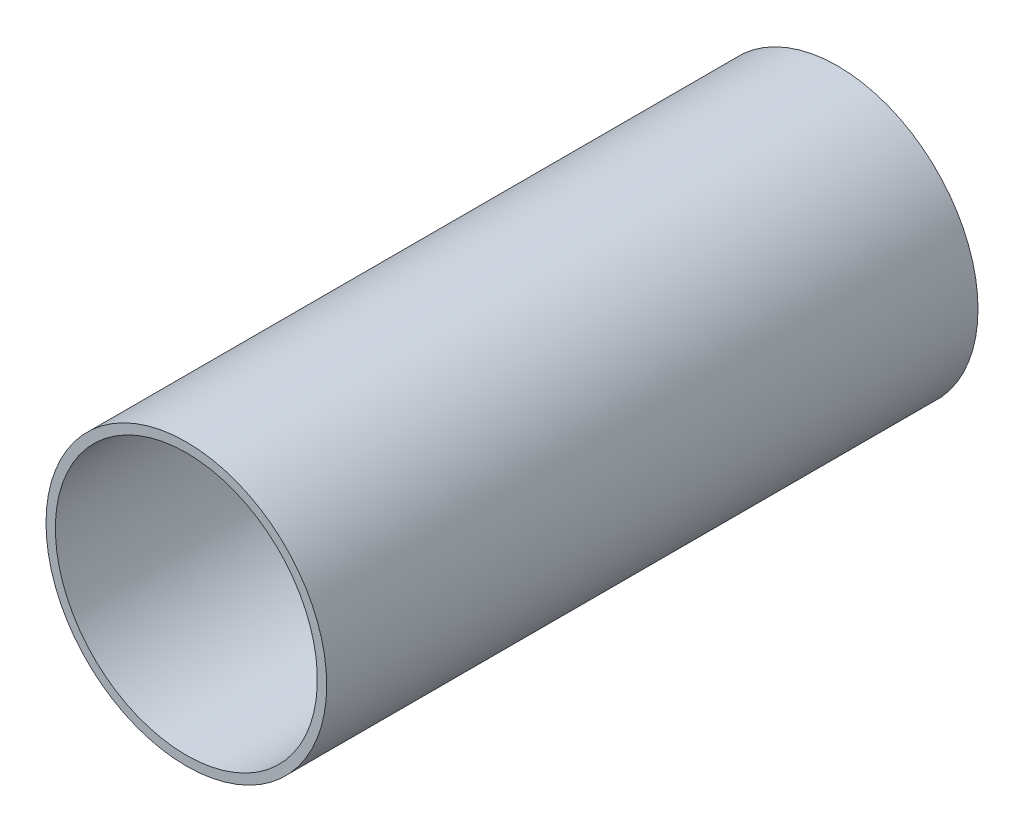
ISO-10303-21;
HEADER;
FILE_DESCRIPTION(('STEP AP214'),'2;1');
FILE_NAME('part.step','',(''),(''),'','','');
FILE_SCHEMA(('AUTOMOTIVE_DESIGN { 1 0 10303 214 1 1 1 1 }'));
ENDSEC;
DATA;
#1=APPLICATION_CONTEXT('core data for automotive mechanical design processes');
#2=APPLICATION_PROTOCOL_DEFINITION('international standard','automotive_design',2000,#1);
#3=PRODUCT_CONTEXT('',#1,'mechanical');
#4=PRODUCT('Part','Part','',(#3));
#5=PRODUCT_RELATED_PRODUCT_CATEGORY('part','',(#4));
#6=PRODUCT_DEFINITION_FORMATION('','',#4);
#7=PRODUCT_DEFINITION_CONTEXT('part definition',#1,'design');
#8=PRODUCT_DEFINITION('design','',#6,#7);
#9=PRODUCT_DEFINITION_SHAPE('','',#8);
#10=(LENGTH_UNIT() NAMED_UNIT(*) SI_UNIT(.MILLI.,.METRE.));
#11=(NAMED_UNIT(*) PLANE_ANGLE_UNIT() SI_UNIT($,.RADIAN.));
#12=(NAMED_UNIT(*) SI_UNIT($,.STERADIAN.) SOLID_ANGLE_UNIT());
#13=UNCERTAINTY_MEASURE_WITH_UNIT(LENGTH_MEASURE(1.E-05),#10,'distance_accuracy_value','');
#14=(GEOMETRIC_REPRESENTATION_CONTEXT(3) GLOBAL_UNCERTAINTY_ASSIGNED_CONTEXT((#13)) GLOBAL_UNIT_ASSIGNED_CONTEXT((#10,
#11,#12)) REPRESENTATION_CONTEXT('',''));
#15=CARTESIAN_POINT('',(0.,0.,0.));
#16=DIRECTION('',(0.,0.,1.));
#17=DIRECTION('',(1.,0.,0.));
#18=AXIS2_PLACEMENT_3D('',#15,#16,#17);
#19=CARTESIAN_POINT('',(115.401,-115.808,-0.045));
#20=DIRECTION('',(0.,0.,-1.));
#21=DIRECTION('',(0.,-1.,0.));
#22=AXIS2_PLACEMENT_3D('',#19,#20,#21);
#23=CYLINDRICAL_SURFACE('',#22,0.35);
#24=CARTESIAN_POINT('',(115.401,-115.808,-0.035));
#25=DIRECTION('',(0.,0.,-1.));
#26=DIRECTION('',(0.,-1.,0.));
#27=AXIS2_PLACEMENT_3D('',#24,#25,#26);
#28=CIRCLE('',#27,0.35);
#29=CARTESIAN_POINT('',(115.401,-116.158,-0.035));
#30=VERTEX_POINT('',#29);
#31=EDGE_CURVE('E64',#30,#30,#28,.T.);
#32=ORIENTED_EDGE('',*,*,#31,.T.);
#33=DIRECTION('',(0.,0.,1.));
#34=VECTOR('',#33,1.);
#35=CARTESIAN_POINT('',(115.401,-116.158,-0.045));
#36=LINE('',#35,#34);
#37=CARTESIAN_POINT('',(115.401,-116.158,1.705));
#38=VERTEX_POINT('',#37);
#39=EDGE_CURVE('E11',#30,#38,#36,.T.);
#40=ORIENTED_EDGE('',*,*,#39,.T.);
#41=CARTESIAN_POINT('',(115.401,-115.808,1.705));
#42=DIRECTION('',(0.,0.,-1.));
#43=DIRECTION('',(0.,-1.,0.));
#44=AXIS2_PLACEMENT_3D('',#41,#42,#43);
#45=CIRCLE('',#44,0.35);
#46=EDGE_CURVE('E25',#38,#38,#45,.T.);
#47=ORIENTED_EDGE('',*,*,#46,.F.);
#48=ORIENTED_EDGE('',*,*,#39,.F.);
#49=EDGE_LOOP('',(#32,#40,#47,#48));
#50=FACE_BOUND('',#49,.T.);
#51=ADVANCED_FACE('F17',(#50),#23,.F.);
#52=CARTESIAN_POINT('',(115.401,-116.183,1.705));
#53=DIRECTION('',(0.,0.,1.));
#54=DIRECTION('',(1.,0.,0.));
#55=AXIS2_PLACEMENT_3D('',#52,#53,#54);
#56=PLANE('',#55);
#57=ORIENTED_EDGE('',*,*,#46,.T.);
#58=EDGE_LOOP('',(#57));
#59=FACE_BOUND('',#58,.T.);
#60=CARTESIAN_POINT('',(115.401,-115.808,1.705));
#61=DIRECTION('',(0.,0.,1.));
#62=DIRECTION('',(0.,-1.,0.));
#63=AXIS2_PLACEMENT_3D('',#60,#61,#62);
#64=CIRCLE('',#63,0.375);
#65=CARTESIAN_POINT('',(115.401,-116.183,1.705));
#66=VERTEX_POINT('',#65);
#67=EDGE_CURVE('E56',#66,#66,#64,.T.);
#68=ORIENTED_EDGE('',*,*,#67,.T.);
#69=EDGE_LOOP('',(#68));
#70=FACE_BOUND('',#69,.T.);
#71=ADVANCED_FACE('F76',(#59,#70),#56,.T.);
#72=CARTESIAN_POINT('',(115.401,-116.183,-0.035));
#73=DIRECTION('',(0.,0.,1.));
#74=DIRECTION('',(1.,0.,0.));
#75=AXIS2_PLACEMENT_3D('',#72,#73,#74);
#76=PLANE('',#75);
#77=ORIENTED_EDGE('',*,*,#31,.F.);
#78=EDGE_LOOP('',(#77));
#79=FACE_BOUND('',#78,.T.);
#80=CARTESIAN_POINT('',(115.401,-115.808,-0.035));
#81=DIRECTION('',(0.,0.,1.));
#82=DIRECTION('',(0.,-1.,0.));
#83=AXIS2_PLACEMENT_3D('',#80,#81,#82);
#84=CIRCLE('',#83,0.375);
#85=CARTESIAN_POINT('',(115.401,-116.183,-0.035));
#86=VERTEX_POINT('',#85);
#87=EDGE_CURVE('E55',#86,#86,#84,.T.);
#88=ORIENTED_EDGE('',*,*,#87,.F.);
#89=EDGE_LOOP('',(#88));
#90=FACE_BOUND('',#89,.T.);
#91=ADVANCED_FACE('F84',(#79,#90),#76,.F.);
#92=CARTESIAN_POINT('',(115.401,-115.808,-0.035));
#93=DIRECTION('',(0.,0.,-1.));
#94=DIRECTION('',(0.,-1.,0.));
#95=AXIS2_PLACEMENT_3D('',#92,#93,#94);
#96=CYLINDRICAL_SURFACE('',#95,0.375);
#97=ORIENTED_EDGE('',*,*,#87,.T.);
#98=DIRECTION('',(0.,0.,1.));
#99=VECTOR('',#98,1.);
#100=CARTESIAN_POINT('',(115.401,-116.183,-0.035));
#101=LINE('',#100,#99);
#102=EDGE_CURVE('E52',#86,#66,#101,.T.);
#103=ORIENTED_EDGE('',*,*,#102,.T.);
#104=ORIENTED_EDGE('',*,*,#67,.F.);
#105=ORIENTED_EDGE('',*,*,#102,.F.);
#106=EDGE_LOOP('',(#97,#103,#104,#105));
#107=FACE_BOUND('',#106,.T.);
#108=ADVANCED_FACE('F53',(#107),#96,.T.);
#109=CLOSED_SHELL('',(#51,#71,#91,#108));
#110=MANIFOLD_SOLID_BREP('B1',#109);
#111=ADVANCED_BREP_SHAPE_REPRESENTATION('',(#18,#110),#14);
#112=SHAPE_DEFINITION_REPRESENTATION(#9,#111);
ENDSEC;
END-ISO-10303-21;
